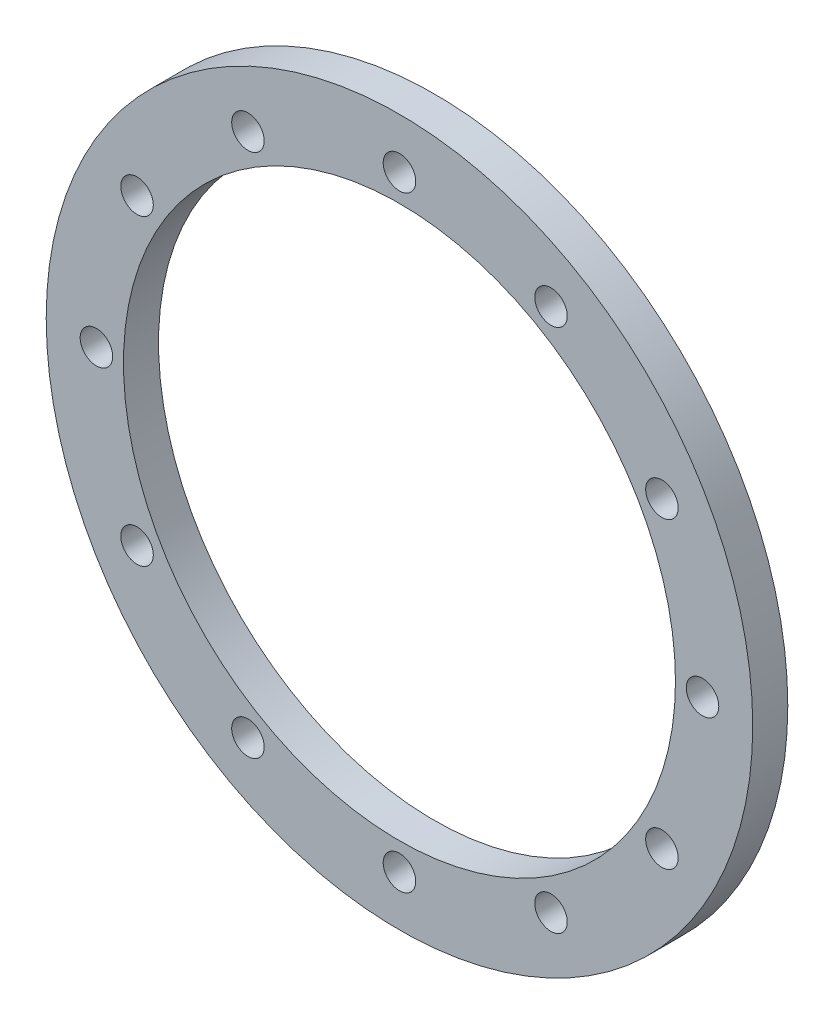
ISO-10303-21;
HEADER;
FILE_DESCRIPTION(('STEP AP214'),'2;1');
FILE_NAME('part.step','',(''),(''),'','','');
FILE_SCHEMA(('AUTOMOTIVE_DESIGN { 1 0 10303 214 1 1 1 1 }'));
ENDSEC;
DATA;
#1=APPLICATION_CONTEXT('core data for automotive mechanical design processes');
#2=APPLICATION_PROTOCOL_DEFINITION('international standard','automotive_design',2000,#1);
#3=PRODUCT_CONTEXT('',#1,'mechanical');
#4=PRODUCT('Part','Part','',(#3));
#5=PRODUCT_RELATED_PRODUCT_CATEGORY('part','',(#4));
#6=PRODUCT_DEFINITION_FORMATION('','',#4);
#7=PRODUCT_DEFINITION_CONTEXT('part definition',#1,'design');
#8=PRODUCT_DEFINITION('design','',#6,#7);
#9=PRODUCT_DEFINITION_SHAPE('','',#8);
#10=(LENGTH_UNIT() NAMED_UNIT(*) SI_UNIT(.MILLI.,.METRE.));
#11=(NAMED_UNIT(*) PLANE_ANGLE_UNIT() SI_UNIT($,.RADIAN.));
#12=(NAMED_UNIT(*) SI_UNIT($,.STERADIAN.) SOLID_ANGLE_UNIT());
#13=UNCERTAINTY_MEASURE_WITH_UNIT(LENGTH_MEASURE(1.E-05),#10,'distance_accuracy_value','');
#14=(GEOMETRIC_REPRESENTATION_CONTEXT(3) GLOBAL_UNCERTAINTY_ASSIGNED_CONTEXT((#13)) GLOBAL_UNIT_ASSIGNED_CONTEXT((#10,
#11,#12)) REPRESENTATION_CONTEXT('',''));
#15=CARTESIAN_POINT('',(0.,0.,0.));
#16=DIRECTION('',(0.,0.,1.));
#17=DIRECTION('',(1.,0.,0.));
#18=AXIS2_PLACEMENT_3D('',#15,#16,#17);
#19=CARTESIAN_POINT('',(-17.5,-28.25,3.37499999999996));
#20=DIRECTION('',(0.,0.,1.));
#21=DIRECTION('',(1.,0.,0.));
#22=AXIS2_PLACEMENT_3D('',#19,#20,#21);
#23=PLANE('',#22);
#24=CARTESIAN_POINT('',(6.27239733388261,-41.9750000000003,3.37499999999996));
#25=DIRECTION('',(0.,0.,1.));
#26=DIRECTION('',(1.,0.,0.));
#27=AXIS2_PLACEMENT_3D('',#24,#25,#26);
#28=CIRCLE('',#27,1.4732);
#29=CARTESIAN_POINT('',(7.74559733388261,-41.9750000000003,3.37499999999996));
#30=VERTEX_POINT('',#29);
#31=EDGE_CURVE('E130',#30,#30,#28,.T.);
#32=ORIENTED_EDGE('',*,*,#31,.F.);
#33=EDGE_LOOP('',(#32));
#34=FACE_BOUND('',#33,.T.);
#35=CARTESIAN_POINT('',(6.27239733388291,-14.5250000000002,3.37499999999996));
#36=DIRECTION('',(0.,0.,1.));
#37=DIRECTION('',(1.,0.,0.));
#38=AXIS2_PLACEMENT_3D('',#35,#36,#37);
#39=CIRCLE('',#38,1.4732);
#40=CARTESIAN_POINT('',(7.74559733388291,-14.5250000000002,3.37499999999996));
#41=VERTEX_POINT('',#40);
#42=EDGE_CURVE('E115',#41,#41,#39,.T.);
#43=ORIENTED_EDGE('',*,*,#42,.F.);
#44=EDGE_LOOP('',(#43));
#45=FACE_BOUND('',#44,.T.);
#46=CARTESIAN_POINT('',(-17.4999999999999,-0.800000000000016,3.37499999999996));
#47=DIRECTION('',(0.,0.,1.));
#48=DIRECTION('',(1.,0.,0.));
#49=AXIS2_PLACEMENT_3D('',#46,#47,#48);
#50=CIRCLE('',#49,1.4732);
#51=CARTESIAN_POINT('',(-16.0267999999999,-0.800000000000016,3.37499999999996));
#52=VERTEX_POINT('',#51);
#53=EDGE_CURVE('E99',#52,#52,#50,.T.);
#54=ORIENTED_EDGE('',*,*,#53,.F.);
#55=EDGE_LOOP('',(#54));
#56=FACE_BOUND('',#55,.T.);
#57=CARTESIAN_POINT('',(-41.2723973338828,-14.5249999999999,3.37499999999996));
#58=DIRECTION('',(0.,0.,1.));
#59=DIRECTION('',(1.,0.,0.));
#60=AXIS2_PLACEMENT_3D('',#57,#58,#59);
#61=CIRCLE('',#60,1.4732);
#62=CARTESIAN_POINT('',(-39.7991973338828,-14.5249999999999,3.37499999999996));
#63=VERTEX_POINT('',#62);
#64=EDGE_CURVE('E86',#63,#63,#61,.T.);
#65=ORIENTED_EDGE('',*,*,#64,.F.);
#66=EDGE_LOOP('',(#65));
#67=FACE_BOUND('',#66,.T.);
#68=CARTESIAN_POINT('',(-41.2723973338829,-41.975,3.37499999999996));
#69=DIRECTION('',(0.,0.,1.));
#70=DIRECTION('',(1.,0.,0.));
#71=AXIS2_PLACEMENT_3D('',#68,#69,#70);
#72=CIRCLE('',#71,1.4732);
#73=CARTESIAN_POINT('',(-39.7991973338829,-41.975,3.37499999999996));
#74=VERTEX_POINT('',#73);
#75=EDGE_CURVE('E69',#74,#74,#72,.T.);
#76=ORIENTED_EDGE('',*,*,#75,.F.);
#77=EDGE_LOOP('',(#76));
#78=FACE_BOUND('',#77,.T.);
#79=CARTESIAN_POINT('',(-17.5,-55.7,3.37499999999996));
#80=DIRECTION('',(0.,0.,1.));
#81=DIRECTION('',(1.,0.,0.));
#82=AXIS2_PLACEMENT_3D('',#79,#80,#81);
#83=CIRCLE('',#82,1.4732);
#84=CARTESIAN_POINT('',(-16.0268,-55.7,3.37499999999996));
#85=VERTEX_POINT('',#84);
#86=EDGE_CURVE('E51',#85,#85,#83,.T.);
#87=ORIENTED_EDGE('',*,*,#86,.F.);
#88=EDGE_LOOP('',(#87));
#89=FACE_BOUND('',#88,.T.);
#90=CARTESIAN_POINT('',(-17.5,-28.25,3.37499999999996));
#91=DIRECTION('',(0.,0.,1.));
#92=DIRECTION('',(1.,0.,0.));
#93=AXIS2_PLACEMENT_3D('',#90,#91,#92);
#94=CIRCLE('',#93,32.);
#95=CARTESIAN_POINT('',(14.5,-28.25,3.37499999999996));
#96=VERTEX_POINT('',#95);
#97=EDGE_CURVE('E11',#96,#96,#94,.T.);
#98=ORIENTED_EDGE('',*,*,#97,.T.);
#99=EDGE_LOOP('',(#98));
#100=FACE_BOUND('',#99,.T.);
#101=CARTESIAN_POINT('',(-17.5,-28.25,3.37499999999996));
#102=DIRECTION('',(0.,0.,1.));
#103=DIRECTION('',(1.,0.,0.));
#104=AXIS2_PLACEMENT_3D('',#101,#102,#103);
#105=CIRCLE('',#104,25.);
#106=CARTESIAN_POINT('',(7.49999999999995,-28.25,3.37499999999996));
#107=VERTEX_POINT('',#106);
#108=EDGE_CURVE('E45',#107,#107,#105,.T.);
#109=ORIENTED_EDGE('',*,*,#108,.F.);
#110=EDGE_LOOP('',(#109));
#111=FACE_BOUND('',#110,.T.);
#112=CARTESIAN_POINT('',(-31.2250000000001,-52.0223973338828,3.37499999999996));
#113=DIRECTION('',(0.,0.,1.));
#114=DIRECTION('',(1.,0.,0.));
#115=AXIS2_PLACEMENT_3D('',#112,#113,#114);
#116=CIRCLE('',#115,1.4732);
#117=CARTESIAN_POINT('',(-29.7518000000001,-52.0223973338828,3.37499999999996));
#118=VERTEX_POINT('',#117);
#119=EDGE_CURVE('E63',#118,#118,#116,.T.);
#120=ORIENTED_EDGE('',*,*,#119,.F.);
#121=EDGE_LOOP('',(#120));
#122=FACE_BOUND('',#121,.T.);
#123=CARTESIAN_POINT('',(-44.95,-28.2499999999999,3.37499999999996));
#124=DIRECTION('',(0.,0.,1.));
#125=DIRECTION('',(1.,0.,0.));
#126=AXIS2_PLACEMENT_3D('',#123,#124,#125);
#127=CIRCLE('',#126,1.4732);
#128=CARTESIAN_POINT('',(-43.4768,-28.2499999999999,3.37499999999996));
#129=VERTEX_POINT('',#128);
#130=EDGE_CURVE('E76',#129,#129,#127,.T.);
#131=ORIENTED_EDGE('',*,*,#130,.F.);
#132=EDGE_LOOP('',(#131));
#133=FACE_BOUND('',#132,.T.);
#134=CARTESIAN_POINT('',(-31.2249999999999,-4.47760266611708,3.37499999999996));
#135=DIRECTION('',(0.,0.,1.));
#136=DIRECTION('',(1.,0.,0.));
#137=AXIS2_PLACEMENT_3D('',#134,#135,#136);
#138=CIRCLE('',#137,1.4732);
#139=CARTESIAN_POINT('',(-29.7517999999999,-4.47760266611708,3.37499999999996));
#140=VERTEX_POINT('',#139);
#141=EDGE_CURVE('E92',#140,#140,#138,.T.);
#142=ORIENTED_EDGE('',*,*,#141,.F.);
#143=EDGE_LOOP('',(#142));
#144=FACE_BOUND('',#143,.T.);
#145=CARTESIAN_POINT('',(-3.77499999999985,-4.47760266611728,3.37499999999996));
#146=DIRECTION('',(0.,0.,1.));
#147=DIRECTION('',(1.,0.,0.));
#148=AXIS2_PLACEMENT_3D('',#145,#146,#147);
#149=CIRCLE('',#148,1.4732);
#150=CARTESIAN_POINT('',(-2.30179999999986,-4.47760266611728,3.37499999999996));
#151=VERTEX_POINT('',#150);
#152=EDGE_CURVE('E109',#151,#151,#149,.T.);
#153=ORIENTED_EDGE('',*,*,#152,.F.);
#154=EDGE_LOOP('',(#153));
#155=FACE_BOUND('',#154,.T.);
#156=CARTESIAN_POINT('',(9.94999999999995,-28.2500000000003,3.37499999999996));
#157=DIRECTION('',(0.,0.,1.));
#158=DIRECTION('',(1.,0.,0.));
#159=AXIS2_PLACEMENT_3D('',#156,#157,#158);
#160=CIRCLE('',#159,1.4732);
#161=CARTESIAN_POINT('',(11.4232,-28.2500000000003,3.37499999999996));
#162=VERTEX_POINT('',#161);
#163=EDGE_CURVE('E122',#162,#162,#160,.T.);
#164=ORIENTED_EDGE('',*,*,#163,.F.);
#165=EDGE_LOOP('',(#164));
#166=FACE_BOUND('',#165,.T.);
#167=CARTESIAN_POINT('',(-3.77500000000035,-52.022397333883,3.37499999999996));
#168=DIRECTION('',(0.,0.,1.));
#169=DIRECTION('',(1.,0.,0.));
#170=AXIS2_PLACEMENT_3D('',#167,#168,#169);
#171=CIRCLE('',#170,1.4732);
#172=CARTESIAN_POINT('',(-2.30180000000035,-52.022397333883,3.37499999999996));
#173=VERTEX_POINT('',#172);
#174=EDGE_CURVE('E136',#173,#173,#171,.T.);
#175=ORIENTED_EDGE('',*,*,#174,.F.);
#176=EDGE_LOOP('',(#175));
#177=FACE_BOUND('',#176,.T.);
#178=ADVANCED_FACE('F33',(#34,#45,#56,#67,#78,#89,#100,#111,#122,#133,#144,#155,#166,#177),#23,.T.);
#179=CARTESIAN_POINT('',(-17.5,-28.25,0.199999999999961));
#180=DIRECTION('',(0.,0.,1.));
#181=DIRECTION('',(1.,0.,0.));
#182=AXIS2_PLACEMENT_3D('',#179,#180,#181);
#183=PLANE('',#182);
#184=CARTESIAN_POINT('',(-17.5,-28.25,0.199999999999961));
#185=DIRECTION('',(0.,0.,1.));
#186=DIRECTION('',(1.,0.,0.));
#187=AXIS2_PLACEMENT_3D('',#184,#185,#186);
#188=CIRCLE('',#187,32.);
#189=CARTESIAN_POINT('',(14.5,-28.25,0.199999999999961));
#190=VERTEX_POINT('',#189);
#191=EDGE_CURVE('E37',#190,#190,#188,.T.);
#192=ORIENTED_EDGE('',*,*,#191,.F.);
#193=EDGE_LOOP('',(#192));
#194=FACE_BOUND('',#193,.T.);
#195=CARTESIAN_POINT('',(-17.5,-28.25,0.199999999999961));
#196=DIRECTION('',(0.,0.,1.));
#197=DIRECTION('',(1.,0.,0.));
#198=AXIS2_PLACEMENT_3D('',#195,#196,#197);
#199=CIRCLE('',#198,25.);
#200=CARTESIAN_POINT('',(7.49999999999995,-28.25,0.199999999999961));
#201=VERTEX_POINT('',#200);
#202=EDGE_CURVE('E47',#201,#201,#199,.T.);
#203=ORIENTED_EDGE('',*,*,#202,.T.);
#204=EDGE_LOOP('',(#203));
#205=FACE_BOUND('',#204,.T.);
#206=CARTESIAN_POINT('',(-17.5,-55.7,0.199999999999961));
#207=DIRECTION('',(0.,0.,1.));
#208=DIRECTION('',(1.,0.,0.));
#209=AXIS2_PLACEMENT_3D('',#206,#207,#208);
#210=CIRCLE('',#209,1.4732);
#211=CARTESIAN_POINT('',(-16.0268,-55.7,0.199999999999961));
#212=VERTEX_POINT('',#211);
#213=EDGE_CURVE('E59',#212,#212,#210,.T.);
#214=ORIENTED_EDGE('',*,*,#213,.T.);
#215=EDGE_LOOP('',(#214));
#216=FACE_BOUND('',#215,.T.);
#217=CARTESIAN_POINT('',(-31.2250000000001,-52.0223973338828,0.199999999999961));
#218=DIRECTION('',(0.,0.,1.));
#219=DIRECTION('',(1.,0.,0.));
#220=AXIS2_PLACEMENT_3D('',#217,#218,#219);
#221=CIRCLE('',#220,1.4732);
#222=CARTESIAN_POINT('',(-29.7518000000001,-52.0223973338828,0.199999999999961));
#223=VERTEX_POINT('',#222);
#224=EDGE_CURVE('E65',#223,#223,#221,.T.);
#225=ORIENTED_EDGE('',*,*,#224,.T.);
#226=EDGE_LOOP('',(#225));
#227=FACE_BOUND('',#226,.T.);
#228=CARTESIAN_POINT('',(-41.2723973338829,-41.975,0.199999999999961));
#229=DIRECTION('',(0.,0.,1.));
#230=DIRECTION('',(1.,0.,0.));
#231=AXIS2_PLACEMENT_3D('',#228,#229,#230);
#232=CIRCLE('',#231,1.4732);
#233=CARTESIAN_POINT('',(-39.7991973338829,-41.975,0.199999999999961));
#234=VERTEX_POINT('',#233);
#235=EDGE_CURVE('E72',#234,#234,#232,.T.);
#236=ORIENTED_EDGE('',*,*,#235,.T.);
#237=EDGE_LOOP('',(#236));
#238=FACE_BOUND('',#237,.T.);
#239=CARTESIAN_POINT('',(-44.95,-28.2499999999999,0.199999999999961));
#240=DIRECTION('',(0.,0.,1.));
#241=DIRECTION('',(1.,0.,0.));
#242=AXIS2_PLACEMENT_3D('',#239,#240,#241);
#243=CIRCLE('',#242,1.4732);
#244=CARTESIAN_POINT('',(-43.4768,-28.2499999999999,0.199999999999961));
#245=VERTEX_POINT('',#244);
#246=EDGE_CURVE('E82',#245,#245,#243,.T.);
#247=ORIENTED_EDGE('',*,*,#246,.T.);
#248=EDGE_LOOP('',(#247));
#249=FACE_BOUND('',#248,.T.);
#250=CARTESIAN_POINT('',(-41.2723973338828,-14.5249999999999,0.199999999999961));
#251=DIRECTION('',(0.,0.,1.));
#252=DIRECTION('',(1.,0.,0.));
#253=AXIS2_PLACEMENT_3D('',#250,#251,#252);
#254=CIRCLE('',#253,1.4732);
#255=CARTESIAN_POINT('',(-39.7991973338828,-14.5249999999999,0.199999999999961));
#256=VERTEX_POINT('',#255);
#257=EDGE_CURVE('E88',#256,#256,#254,.T.);
#258=ORIENTED_EDGE('',*,*,#257,.T.);
#259=EDGE_LOOP('',(#258));
#260=FACE_BOUND('',#259,.T.);
#261=CARTESIAN_POINT('',(-31.2249999999999,-4.47760266611708,0.199999999999961));
#262=DIRECTION('',(0.,0.,1.));
#263=DIRECTION('',(1.,0.,0.));
#264=AXIS2_PLACEMENT_3D('',#261,#262,#263);
#265=CIRCLE('',#264,1.4732);
#266=CARTESIAN_POINT('',(-29.7517999999999,-4.47760266611708,0.199999999999961));
#267=VERTEX_POINT('',#266);
#268=EDGE_CURVE('E95',#267,#267,#265,.T.);
#269=ORIENTED_EDGE('',*,*,#268,.T.);
#270=EDGE_LOOP('',(#269));
#271=FACE_BOUND('',#270,.T.);
#272=CARTESIAN_POINT('',(-17.4999999999999,-0.800000000000016,0.199999999999961));
#273=DIRECTION('',(0.,0.,1.));
#274=DIRECTION('',(1.,0.,0.));
#275=AXIS2_PLACEMENT_3D('',#272,#273,#274);
#276=CIRCLE('',#275,1.4732);
#277=CARTESIAN_POINT('',(-16.0267999999999,-0.800000000000016,0.199999999999961));
#278=VERTEX_POINT('',#277);
#279=EDGE_CURVE('E105',#278,#278,#276,.T.);
#280=ORIENTED_EDGE('',*,*,#279,.T.);
#281=EDGE_LOOP('',(#280));
#282=FACE_BOUND('',#281,.T.);
#283=CARTESIAN_POINT('',(-3.77499999999985,-4.47760266611728,0.199999999999961));
#284=DIRECTION('',(0.,0.,1.));
#285=DIRECTION('',(1.,0.,0.));
#286=AXIS2_PLACEMENT_3D('',#283,#284,#285);
#287=CIRCLE('',#286,1.4732);
#288=CARTESIAN_POINT('',(-2.30179999999986,-4.47760266611728,0.199999999999961));
#289=VERTEX_POINT('',#288);
#290=EDGE_CURVE('E111',#289,#289,#287,.T.);
#291=ORIENTED_EDGE('',*,*,#290,.T.);
#292=EDGE_LOOP('',(#291));
#293=FACE_BOUND('',#292,.T.);
#294=CARTESIAN_POINT('',(6.27239733388291,-14.5250000000002,0.199999999999961));
#295=DIRECTION('',(0.,0.,1.));
#296=DIRECTION('',(1.,0.,0.));
#297=AXIS2_PLACEMENT_3D('',#294,#295,#296);
#298=CIRCLE('',#297,1.4732);
#299=CARTESIAN_POINT('',(7.74559733388291,-14.5250000000002,0.199999999999961));
#300=VERTEX_POINT('',#299);
#301=EDGE_CURVE('E118',#300,#300,#298,.T.);
#302=ORIENTED_EDGE('',*,*,#301,.T.);
#303=EDGE_LOOP('',(#302));
#304=FACE_BOUND('',#303,.T.);
#305=CARTESIAN_POINT('',(9.94999999999995,-28.2500000000003,0.199999999999961));
#306=DIRECTION('',(0.,0.,1.));
#307=DIRECTION('',(1.,0.,0.));
#308=AXIS2_PLACEMENT_3D('',#305,#306,#307);
#309=CIRCLE('',#308,1.4732);
#310=CARTESIAN_POINT('',(11.4232,-28.2500000000003,0.199999999999961));
#311=VERTEX_POINT('',#310);
#312=EDGE_CURVE('E126',#311,#311,#309,.T.);
#313=ORIENTED_EDGE('',*,*,#312,.T.);
#314=EDGE_LOOP('',(#313));
#315=FACE_BOUND('',#314,.T.);
#316=CARTESIAN_POINT('',(6.27239733388261,-41.9750000000003,0.199999999999961));
#317=DIRECTION('',(0.,0.,1.));
#318=DIRECTION('',(1.,0.,0.));
#319=AXIS2_PLACEMENT_3D('',#316,#317,#318);
#320=CIRCLE('',#319,1.4732);
#321=CARTESIAN_POINT('',(7.74559733388261,-41.9750000000003,0.199999999999961));
#322=VERTEX_POINT('',#321);
#323=EDGE_CURVE('E132',#322,#322,#320,.T.);
#324=ORIENTED_EDGE('',*,*,#323,.T.);
#325=EDGE_LOOP('',(#324));
#326=FACE_BOUND('',#325,.T.);
#327=CARTESIAN_POINT('',(-3.77500000000035,-52.022397333883,0.199999999999961));
#328=DIRECTION('',(0.,0.,1.));
#329=DIRECTION('',(1.,0.,0.));
#330=AXIS2_PLACEMENT_3D('',#327,#328,#329);
#331=CIRCLE('',#330,1.4732);
#332=CARTESIAN_POINT('',(-2.30180000000035,-52.022397333883,0.199999999999961));
#333=VERTEX_POINT('',#332);
#334=EDGE_CURVE('E138',#333,#333,#331,.T.);
#335=ORIENTED_EDGE('',*,*,#334,.T.);
#336=EDGE_LOOP('',(#335));
#337=FACE_BOUND('',#336,.T.);
#338=ADVANCED_FACE('F149',(#194,#205,#216,#227,#238,#249,#260,#271,#282,#293,#304,#315,#326,
#337),#183,.F.);
#339=CARTESIAN_POINT('',(-17.5,-28.25,3.37499999999996));
#340=DIRECTION('',(0.,0.,-1.));
#341=DIRECTION('',(-1.,0.,0.));
#342=AXIS2_PLACEMENT_3D('',#339,#340,#341);
#343=CYLINDRICAL_SURFACE('',#342,32.);
#344=ORIENTED_EDGE('',*,*,#97,.F.);
#345=EDGE_LOOP('',(#344));
#346=FACE_BOUND('',#345,.T.);
#347=ORIENTED_EDGE('',*,*,#191,.T.);
#348=EDGE_LOOP('',(#347));
#349=FACE_BOUND('',#348,.T.);
#350=ADVANCED_FACE('F35',(#346,#349),#343,.T.);
#351=CARTESIAN_POINT('',(-17.5,-28.25,3.37499999999996));
#352=DIRECTION('',(0.,0.,-1.));
#353=DIRECTION('',(-1.,0.,0.));
#354=AXIS2_PLACEMENT_3D('',#351,#352,#353);
#355=CYLINDRICAL_SURFACE('',#354,25.);
#356=ORIENTED_EDGE('',*,*,#108,.T.);
#357=EDGE_LOOP('',(#356));
#358=FACE_BOUND('',#357,.T.);
#359=ORIENTED_EDGE('',*,*,#202,.F.);
#360=EDGE_LOOP('',(#359));
#361=FACE_BOUND('',#360,.T.);
#362=ADVANCED_FACE('F159',(#358,#361),#355,.F.);
#363=CARTESIAN_POINT('',(-17.5,-55.7,3.37499999999996));
#364=DIRECTION('',(0.,0.,-1.));
#365=DIRECTION('',(-1.,0.,0.));
#366=AXIS2_PLACEMENT_3D('',#363,#364,#365);
#367=CYLINDRICAL_SURFACE('',#366,1.4732);
#368=ORIENTED_EDGE('',*,*,#86,.T.);
#369=EDGE_LOOP('',(#368));
#370=FACE_BOUND('',#369,.T.);
#371=ORIENTED_EDGE('',*,*,#213,.F.);
#372=EDGE_LOOP('',(#371));
#373=FACE_BOUND('',#372,.T.);
#374=ADVANCED_FACE('F162',(#370,#373),#367,.F.);
#375=CARTESIAN_POINT('',(-31.2250000000001,-52.0223973338828,3.37499999999996));
#376=DIRECTION('',(0.,0.,-1.));
#377=DIRECTION('',(-1.,0.,0.));
#378=AXIS2_PLACEMENT_3D('',#375,#376,#377);
#379=CYLINDRICAL_SURFACE('',#378,1.4732);
#380=ORIENTED_EDGE('',*,*,#119,.T.);
#381=EDGE_LOOP('',(#380));
#382=FACE_BOUND('',#381,.T.);
#383=ORIENTED_EDGE('',*,*,#224,.F.);
#384=EDGE_LOOP('',(#383));
#385=FACE_BOUND('',#384,.T.);
#386=ADVANCED_FACE('F166',(#382,#385),#379,.F.);
#387=CARTESIAN_POINT('',(-41.2723973338829,-41.975,3.37499999999996));
#388=DIRECTION('',(0.,0.,-1.));
#389=DIRECTION('',(-1.,0.,0.));
#390=AXIS2_PLACEMENT_3D('',#387,#388,#389);
#391=CYLINDRICAL_SURFACE('',#390,1.4732);
#392=ORIENTED_EDGE('',*,*,#75,.T.);
#393=EDGE_LOOP('',(#392));
#394=FACE_BOUND('',#393,.T.);
#395=ORIENTED_EDGE('',*,*,#235,.F.);
#396=EDGE_LOOP('',(#395));
#397=FACE_BOUND('',#396,.T.);
#398=ADVANCED_FACE('F170',(#394,#397),#391,.F.);
#399=CARTESIAN_POINT('',(-44.95,-28.2499999999999,3.37499999999996));
#400=DIRECTION('',(0.,0.,-1.));
#401=DIRECTION('',(-1.,0.,0.));
#402=AXIS2_PLACEMENT_3D('',#399,#400,#401);
#403=CYLINDRICAL_SURFACE('',#402,1.4732);
#404=ORIENTED_EDGE('',*,*,#130,.T.);
#405=EDGE_LOOP('',(#404));
#406=FACE_BOUND('',#405,.T.);
#407=ORIENTED_EDGE('',*,*,#246,.F.);
#408=EDGE_LOOP('',(#407));
#409=FACE_BOUND('',#408,.T.);
#410=ADVANCED_FACE('F174',(#406,#409),#403,.F.);
#411=CARTESIAN_POINT('',(-41.2723973338828,-14.5249999999999,3.37499999999996));
#412=DIRECTION('',(0.,0.,-1.));
#413=DIRECTION('',(-1.,0.,0.));
#414=AXIS2_PLACEMENT_3D('',#411,#412,#413);
#415=CYLINDRICAL_SURFACE('',#414,1.4732);
#416=ORIENTED_EDGE('',*,*,#64,.T.);
#417=EDGE_LOOP('',(#416));
#418=FACE_BOUND('',#417,.T.);
#419=ORIENTED_EDGE('',*,*,#257,.F.);
#420=EDGE_LOOP('',(#419));
#421=FACE_BOUND('',#420,.T.);
#422=ADVANCED_FACE('F178',(#418,#421),#415,.F.);
#423=CARTESIAN_POINT('',(-31.2249999999999,-4.47760266611708,3.37499999999996));
#424=DIRECTION('',(0.,0.,-1.));
#425=DIRECTION('',(-1.,0.,0.));
#426=AXIS2_PLACEMENT_3D('',#423,#424,#425);
#427=CYLINDRICAL_SURFACE('',#426,1.4732);
#428=ORIENTED_EDGE('',*,*,#141,.T.);
#429=EDGE_LOOP('',(#428));
#430=FACE_BOUND('',#429,.T.);
#431=ORIENTED_EDGE('',*,*,#268,.F.);
#432=EDGE_LOOP('',(#431));
#433=FACE_BOUND('',#432,.T.);
#434=ADVANCED_FACE('F182',(#430,#433),#427,.F.);
#435=CARTESIAN_POINT('',(-17.4999999999999,-0.800000000000016,3.37499999999996));
#436=DIRECTION('',(0.,0.,-1.));
#437=DIRECTION('',(-1.,0.,0.));
#438=AXIS2_PLACEMENT_3D('',#435,#436,#437);
#439=CYLINDRICAL_SURFACE('',#438,1.4732);
#440=ORIENTED_EDGE('',*,*,#53,.T.);
#441=EDGE_LOOP('',(#440));
#442=FACE_BOUND('',#441,.T.);
#443=ORIENTED_EDGE('',*,*,#279,.F.);
#444=EDGE_LOOP('',(#443));
#445=FACE_BOUND('',#444,.T.);
#446=ADVANCED_FACE('F186',(#442,#445),#439,.F.);
#447=CARTESIAN_POINT('',(-3.77499999999985,-4.47760266611728,3.37499999999996));
#448=DIRECTION('',(0.,0.,-1.));
#449=DIRECTION('',(-1.,0.,0.));
#450=AXIS2_PLACEMENT_3D('',#447,#448,#449);
#451=CYLINDRICAL_SURFACE('',#450,1.4732);
#452=ORIENTED_EDGE('',*,*,#152,.T.);
#453=EDGE_LOOP('',(#452));
#454=FACE_BOUND('',#453,.T.);
#455=ORIENTED_EDGE('',*,*,#290,.F.);
#456=EDGE_LOOP('',(#455));
#457=FACE_BOUND('',#456,.T.);
#458=ADVANCED_FACE('F190',(#454,#457),#451,.F.);
#459=CARTESIAN_POINT('',(6.27239733388291,-14.5250000000002,3.37499999999996));
#460=DIRECTION('',(0.,0.,-1.));
#461=DIRECTION('',(-1.,0.,0.));
#462=AXIS2_PLACEMENT_3D('',#459,#460,#461);
#463=CYLINDRICAL_SURFACE('',#462,1.4732);
#464=ORIENTED_EDGE('',*,*,#42,.T.);
#465=EDGE_LOOP('',(#464));
#466=FACE_BOUND('',#465,.T.);
#467=ORIENTED_EDGE('',*,*,#301,.F.);
#468=EDGE_LOOP('',(#467));
#469=FACE_BOUND('',#468,.T.);
#470=ADVANCED_FACE('F194',(#466,#469),#463,.F.);
#471=CARTESIAN_POINT('',(9.94999999999995,-28.2500000000003,3.37499999999996));
#472=DIRECTION('',(0.,0.,-1.));
#473=DIRECTION('',(-1.,0.,0.));
#474=AXIS2_PLACEMENT_3D('',#471,#472,#473);
#475=CYLINDRICAL_SURFACE('',#474,1.4732);
#476=ORIENTED_EDGE('',*,*,#163,.T.);
#477=EDGE_LOOP('',(#476));
#478=FACE_BOUND('',#477,.T.);
#479=ORIENTED_EDGE('',*,*,#312,.F.);
#480=EDGE_LOOP('',(#479));
#481=FACE_BOUND('',#480,.T.);
#482=ADVANCED_FACE('F198',(#478,#481),#475,.F.);
#483=CARTESIAN_POINT('',(6.27239733388261,-41.9750000000003,3.37499999999996));
#484=DIRECTION('',(0.,0.,-1.));
#485=DIRECTION('',(-1.,0.,0.));
#486=AXIS2_PLACEMENT_3D('',#483,#484,#485);
#487=CYLINDRICAL_SURFACE('',#486,1.4732);
#488=ORIENTED_EDGE('',*,*,#31,.T.);
#489=EDGE_LOOP('',(#488));
#490=FACE_BOUND('',#489,.T.);
#491=ORIENTED_EDGE('',*,*,#323,.F.);
#492=EDGE_LOOP('',(#491));
#493=FACE_BOUND('',#492,.T.);
#494=ADVANCED_FACE('F202',(#490,#493),#487,.F.);
#495=CARTESIAN_POINT('',(-3.77500000000035,-52.022397333883,3.37499999999996));
#496=DIRECTION('',(0.,0.,-1.));
#497=DIRECTION('',(-1.,0.,0.));
#498=AXIS2_PLACEMENT_3D('',#495,#496,#497);
#499=CYLINDRICAL_SURFACE('',#498,1.4732);
#500=ORIENTED_EDGE('',*,*,#174,.T.);
#501=EDGE_LOOP('',(#500));
#502=FACE_BOUND('',#501,.T.);
#503=ORIENTED_EDGE('',*,*,#334,.F.);
#504=EDGE_LOOP('',(#503));
#505=FACE_BOUND('',#504,.T.);
#506=ADVANCED_FACE('F145',(#502,#505),#499,.F.);
#507=CLOSED_SHELL('',(#178,#338,#350,#362,#374,#386,#398,#410,#422,#434,#446,#458,#470,#482,
#494,#506));
#508=MANIFOLD_SOLID_BREP('B2',#507);
#509=ADVANCED_BREP_SHAPE_REPRESENTATION('',(#18,#508),#14);
#510=SHAPE_DEFINITION_REPRESENTATION(#9,#509);
ENDSEC;
END-ISO-10303-21;
